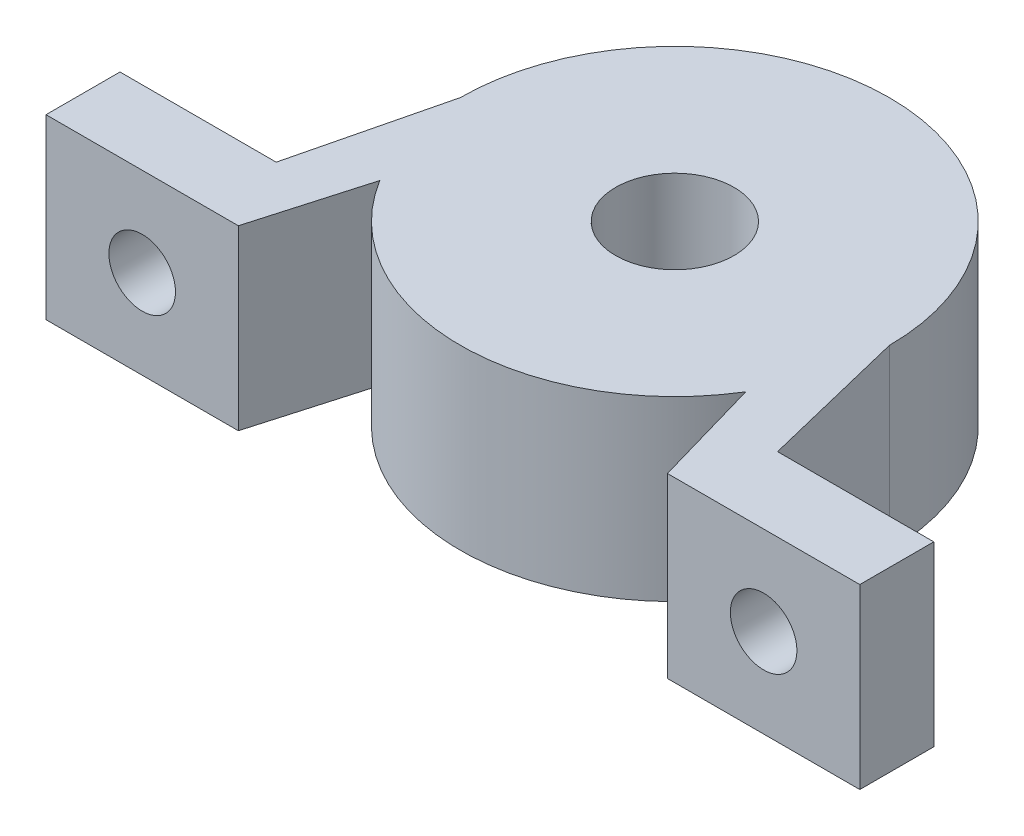
ISO-10303-21;
HEADER;
FILE_DESCRIPTION(('STEP AP214'),'2;1');
FILE_NAME('part.step','',(''),(''),'','','');
FILE_SCHEMA(('AUTOMOTIVE_DESIGN { 1 0 10303 214 1 1 1 1 }'));
ENDSEC;
DATA;
#1=APPLICATION_CONTEXT('core data for automotive mechanical design processes');
#2=APPLICATION_PROTOCOL_DEFINITION('international standard','automotive_design',2000,#1);
#3=PRODUCT_CONTEXT('',#1,'mechanical');
#4=PRODUCT('Part','Part','',(#3));
#5=PRODUCT_RELATED_PRODUCT_CATEGORY('part','',(#4));
#6=PRODUCT_DEFINITION_FORMATION('','',#4);
#7=PRODUCT_DEFINITION_CONTEXT('part definition',#1,'design');
#8=PRODUCT_DEFINITION('design','',#6,#7);
#9=PRODUCT_DEFINITION_SHAPE('','',#8);
#10=(LENGTH_UNIT() NAMED_UNIT(*) SI_UNIT(.MILLI.,.METRE.));
#11=(NAMED_UNIT(*) PLANE_ANGLE_UNIT() SI_UNIT($,.RADIAN.));
#12=(NAMED_UNIT(*) SI_UNIT($,.STERADIAN.) SOLID_ANGLE_UNIT());
#13=UNCERTAINTY_MEASURE_WITH_UNIT(LENGTH_MEASURE(1.E-05),#10,'distance_accuracy_value','');
#14=(GEOMETRIC_REPRESENTATION_CONTEXT(3) GLOBAL_UNCERTAINTY_ASSIGNED_CONTEXT((#13)) GLOBAL_UNIT_ASSIGNED_CONTEXT((#10,
#11,#12)) REPRESENTATION_CONTEXT('',''));
#15=CARTESIAN_POINT('',(0.,0.,0.));
#16=DIRECTION('',(0.,0.,1.));
#17=DIRECTION('',(1.,0.,0.));
#18=AXIS2_PLACEMENT_3D('',#15,#16,#17);
#19=CARTESIAN_POINT('',(0.,12.,0.));
#20=DIRECTION('',(0.,1.,0.));
#21=DIRECTION('',(0.,0.,1.));
#22=AXIS2_PLACEMENT_3D('',#19,#20,#21);
#23=PLANE('',#22);
#24=DIRECTION('',(-1.,0.,0.));
#25=VECTOR('',#24,1.);
#26=CARTESIAN_POINT('',(-27.5,12.,10.));
#27=LINE('',#26,#25);
#28=CARTESIAN_POINT('',(-16.9428664837457,12.,10.));
#29=VERTEX_POINT('',#28);
#30=CARTESIAN_POINT('',(-27.5,12.,10.));
#31=VERTEX_POINT('',#30);
#32=EDGE_CURVE('E177',#29,#31,#27,.T.);
#33=ORIENTED_EDGE('',*,*,#32,.T.);
#34=DIRECTION('',(0.,0.,1.));
#35=VECTOR('',#34,1.);
#36=CARTESIAN_POINT('',(-27.5,12.,10.));
#37=LINE('',#36,#35);
#38=CARTESIAN_POINT('',(-27.5,12.,15.));
#39=VERTEX_POINT('',#38);
#40=EDGE_CURVE('E105',#31,#39,#37,.T.);
#41=ORIENTED_EDGE('',*,*,#40,.T.);
#42=DIRECTION('',(1.,0.,0.));
#43=VECTOR('',#42,1.);
#44=CARTESIAN_POINT('',(-27.5,12.,15.));
#45=LINE('',#44,#43);
#46=CARTESIAN_POINT('',(-14.5,12.,15.));
#47=VERTEX_POINT('',#46);
#48=EDGE_CURVE('E205',#39,#47,#45,.T.);
#49=ORIENTED_EDGE('',*,*,#48,.T.);
#50=DIRECTION('',(0.276037661208606,0.,-0.961146819999152));
#51=VECTOR('',#50,1.);
#52=CARTESIAN_POINT('',(-14.5,12.,15.));
#53=LINE('',#52,#51);
#54=CARTESIAN_POINT('',(-12.3664407470335,12.,7.57107279387208));
#55=VERTEX_POINT('',#54);
#56=EDGE_CURVE('E224',#47,#55,#53,.T.);
#57=ORIENTED_EDGE('',*,*,#56,.T.);
#58=CARTESIAN_POINT('',(0.,12.,0.));
#59=DIRECTION('',(0.,1.,0.));
#60=DIRECTION('',(0.,0.,1.));
#61=AXIS2_PLACEMENT_3D('',#58,#59,#60);
#62=CIRCLE('',#61,14.5);
#63=CARTESIAN_POINT('',(12.3664407470335,12.,7.57107279387208));
#64=VERTEX_POINT('',#63);
#65=EDGE_CURVE('E221',#55,#64,#62,.T.);
#66=ORIENTED_EDGE('',*,*,#65,.T.);
#67=DIRECTION('',(0.276037661208606,0.,0.961146819999152));
#68=VECTOR('',#67,1.);
#69=CARTESIAN_POINT('',(14.5,12.,15.));
#70=LINE('',#69,#68);
#71=CARTESIAN_POINT('',(14.5,12.,15.));
#72=VERTEX_POINT('',#71);
#73=EDGE_CURVE('E223',#64,#72,#70,.T.);
#74=ORIENTED_EDGE('',*,*,#73,.T.);
#75=DIRECTION('',(1.,0.,0.));
#76=VECTOR('',#75,1.);
#77=CARTESIAN_POINT('',(27.5,12.,15.));
#78=LINE('',#77,#76);
#79=CARTESIAN_POINT('',(27.5,12.,15.));
#80=VERTEX_POINT('',#79);
#81=EDGE_CURVE('E226',#72,#80,#78,.T.);
#82=ORIENTED_EDGE('',*,*,#81,.T.);
#83=DIRECTION('',(0.,0.,-1.));
#84=VECTOR('',#83,1.);
#85=CARTESIAN_POINT('',(27.5,12.,10.));
#86=LINE('',#85,#84);
#87=CARTESIAN_POINT('',(27.5,12.,10.));
#88=VERTEX_POINT('',#87);
#89=EDGE_CURVE('E232',#80,#88,#86,.T.);
#90=ORIENTED_EDGE('',*,*,#89,.T.);
#91=DIRECTION('',(-1.,0.,0.));
#92=VECTOR('',#91,1.);
#93=CARTESIAN_POINT('',(27.5,12.,10.));
#94=LINE('',#93,#92);
#95=CARTESIAN_POINT('',(16.9428664837457,12.,10.));
#96=VERTEX_POINT('',#95);
#97=EDGE_CURVE('E136',#88,#96,#94,.T.);
#98=ORIENTED_EDGE('',*,*,#97,.T.);
#99=DIRECTION('',(-0.237308442336912,0.,-0.971434353518357));
#100=VECTOR('',#99,1.);
#101=CARTESIAN_POINT('',(16.9428664837457,12.,10.));
#102=LINE('',#101,#100);
#103=CARTESIAN_POINT('',(14.5,12.,0.));
#104=VERTEX_POINT('',#103);
#105=EDGE_CURVE('E130',#96,#104,#102,.T.);
#106=ORIENTED_EDGE('',*,*,#105,.T.);
#107=CARTESIAN_POINT('',(0.,12.,0.));
#108=DIRECTION('',(0.,1.,0.));
#109=DIRECTION('',(0.,0.,1.));
#110=AXIS2_PLACEMENT_3D('',#107,#108,#109);
#111=CIRCLE('',#110,14.5);
#112=CARTESIAN_POINT('',(-14.5,12.,0.));
#113=VERTEX_POINT('',#112);
#114=EDGE_CURVE('E134',#104,#113,#111,.T.);
#115=ORIENTED_EDGE('',*,*,#114,.T.);
#116=DIRECTION('',(-0.237308442336912,0.,0.971434353518357));
#117=VECTOR('',#116,1.);
#118=CARTESIAN_POINT('',(-16.9428664837457,12.,10.));
#119=LINE('',#118,#117);
#120=EDGE_CURVE('E50',#113,#29,#119,.T.);
#121=ORIENTED_EDGE('',*,*,#120,.T.);
#122=EDGE_LOOP('',(#33,#41,#49,#57,#66,#74,#82,#90,#98,#106,#115,#121));
#123=FACE_BOUND('',#122,.T.);
#124=CARTESIAN_POINT('',(0.,12.,0.));
#125=DIRECTION('',(0.,1.,0.));
#126=DIRECTION('',(0.,0.,1.));
#127=AXIS2_PLACEMENT_3D('',#124,#125,#126);
#128=CIRCLE('',#127,4.);
#129=CARTESIAN_POINT('',(0.,12.,4.));
#130=VERTEX_POINT('',#129);
#131=EDGE_CURVE('E158',#130,#130,#128,.T.);
#132=ORIENTED_EDGE('',*,*,#131,.F.);
#133=EDGE_LOOP('',(#132));
#134=FACE_BOUND('',#133,.T.);
#135=ADVANCED_FACE('F32',(#123,#134),#23,.T.);
#136=CARTESIAN_POINT('',(0.,0.,0.));
#137=DIRECTION('',(0.,1.,0.));
#138=DIRECTION('',(0.,0.,1.));
#139=AXIS2_PLACEMENT_3D('',#136,#137,#138);
#140=PLANE('',#139);
#141=DIRECTION('',(-1.,0.,0.));
#142=VECTOR('',#141,1.);
#143=CARTESIAN_POINT('',(-27.5,0.,10.));
#144=LINE('',#143,#142);
#145=CARTESIAN_POINT('',(-16.9428664837457,0.,10.));
#146=VERTEX_POINT('',#145);
#147=CARTESIAN_POINT('',(-27.5,0.,10.));
#148=VERTEX_POINT('',#147);
#149=EDGE_CURVE('E154',#146,#148,#144,.T.);
#150=ORIENTED_EDGE('',*,*,#149,.F.);
#151=DIRECTION('',(-0.237308442336912,0.,0.971434353518357));
#152=VECTOR('',#151,1.);
#153=CARTESIAN_POINT('',(-16.9428664837457,0.,10.));
#154=LINE('',#153,#152);
#155=CARTESIAN_POINT('',(-14.5,0.,0.));
#156=VERTEX_POINT('',#155);
#157=EDGE_CURVE('E97',#156,#146,#154,.T.);
#158=ORIENTED_EDGE('',*,*,#157,.F.);
#159=CARTESIAN_POINT('',(0.,0.,0.));
#160=DIRECTION('',(0.,1.,0.));
#161=DIRECTION('',(0.,0.,1.));
#162=AXIS2_PLACEMENT_3D('',#159,#160,#161);
#163=CIRCLE('',#162,14.5);
#164=CARTESIAN_POINT('',(14.5,0.,0.));
#165=VERTEX_POINT('',#164);
#166=EDGE_CURVE('E91',#165,#156,#163,.T.);
#167=ORIENTED_EDGE('',*,*,#166,.F.);
#168=DIRECTION('',(-0.237308442336912,0.,-0.971434353518357));
#169=VECTOR('',#168,1.);
#170=CARTESIAN_POINT('',(16.9428664837457,0.,10.));
#171=LINE('',#170,#169);
#172=CARTESIAN_POINT('',(16.9428664837457,0.,10.));
#173=VERTEX_POINT('',#172);
#174=EDGE_CURVE('E144',#173,#165,#171,.T.);
#175=ORIENTED_EDGE('',*,*,#174,.F.);
#176=DIRECTION('',(-1.,0.,0.));
#177=VECTOR('',#176,1.);
#178=CARTESIAN_POINT('',(27.5,0.,10.));
#179=LINE('',#178,#177);
#180=CARTESIAN_POINT('',(27.5,0.,10.));
#181=VERTEX_POINT('',#180);
#182=EDGE_CURVE('E172',#181,#173,#179,.T.);
#183=ORIENTED_EDGE('',*,*,#182,.F.);
#184=DIRECTION('',(0.,0.,-1.));
#185=VECTOR('',#184,1.);
#186=CARTESIAN_POINT('',(27.5,0.,10.));
#187=LINE('',#186,#185);
#188=CARTESIAN_POINT('',(27.5,0.,15.));
#189=VERTEX_POINT('',#188);
#190=EDGE_CURVE('E170',#189,#181,#187,.T.);
#191=ORIENTED_EDGE('',*,*,#190,.F.);
#192=DIRECTION('',(1.,0.,0.));
#193=VECTOR('',#192,1.);
#194=CARTESIAN_POINT('',(27.5,0.,15.));
#195=LINE('',#194,#193);
#196=CARTESIAN_POINT('',(14.5,0.,15.));
#197=VERTEX_POINT('',#196);
#198=EDGE_CURVE('E168',#197,#189,#195,.T.);
#199=ORIENTED_EDGE('',*,*,#198,.F.);
#200=DIRECTION('',(0.276037661208606,0.,0.961146819999152));
#201=VECTOR('',#200,1.);
#202=CARTESIAN_POINT('',(14.5,0.,15.));
#203=LINE('',#202,#201);
#204=CARTESIAN_POINT('',(12.3664407470335,0.,7.57107279387208));
#205=VERTEX_POINT('',#204);
#206=EDGE_CURVE('E166',#205,#197,#203,.T.);
#207=ORIENTED_EDGE('',*,*,#206,.F.);
#208=CARTESIAN_POINT('',(0.,0.,0.));
#209=DIRECTION('',(0.,1.,0.));
#210=DIRECTION('',(0.,0.,1.));
#211=AXIS2_PLACEMENT_3D('',#208,#209,#210);
#212=CIRCLE('',#211,14.5);
#213=CARTESIAN_POINT('',(-12.3664407470335,0.,7.57107279387208));
#214=VERTEX_POINT('',#213);
#215=EDGE_CURVE('E164',#214,#205,#212,.T.);
#216=ORIENTED_EDGE('',*,*,#215,.F.);
#217=DIRECTION('',(0.276037661208606,0.,-0.961146819999152));
#218=VECTOR('',#217,1.);
#219=CARTESIAN_POINT('',(-14.5,0.,15.));
#220=LINE('',#219,#218);
#221=CARTESIAN_POINT('',(-14.5,0.,15.));
#222=VERTEX_POINT('',#221);
#223=EDGE_CURVE('E162',#222,#214,#220,.T.);
#224=ORIENTED_EDGE('',*,*,#223,.F.);
#225=DIRECTION('',(1.,0.,0.));
#226=VECTOR('',#225,1.);
#227=CARTESIAN_POINT('',(-27.5,0.,15.));
#228=LINE('',#227,#226);
#229=CARTESIAN_POINT('',(-27.5,0.,15.));
#230=VERTEX_POINT('',#229);
#231=EDGE_CURVE('E160',#230,#222,#228,.T.);
#232=ORIENTED_EDGE('',*,*,#231,.F.);
#233=DIRECTION('',(0.,0.,1.));
#234=VECTOR('',#233,1.);
#235=CARTESIAN_POINT('',(-27.5,0.,10.));
#236=LINE('',#235,#234);
#237=EDGE_CURVE('E157',#148,#230,#236,.T.);
#238=ORIENTED_EDGE('',*,*,#237,.F.);
#239=EDGE_LOOP('',(#150,#158,#167,#175,#183,#191,#199,#207,#216,#224,#232,#238));
#240=FACE_BOUND('',#239,.T.);
#241=CARTESIAN_POINT('',(0.,0.,0.));
#242=DIRECTION('',(0.,1.,0.));
#243=DIRECTION('',(0.,0.,1.));
#244=AXIS2_PLACEMENT_3D('',#241,#242,#243);
#245=CIRCLE('',#244,4.);
#246=CARTESIAN_POINT('',(0.,0.,4.));
#247=VERTEX_POINT('',#246);
#248=EDGE_CURVE('E288',#247,#247,#245,.T.);
#249=ORIENTED_EDGE('',*,*,#248,.T.);
#250=EDGE_LOOP('',(#249));
#251=FACE_BOUND('',#250,.T.);
#252=ADVANCED_FACE('F209',(#240,#251),#140,.F.);
#253=CARTESIAN_POINT('',(-27.5,12.,10.));
#254=DIRECTION('',(0.,0.,1.));
#255=DIRECTION('',(1.,0.,0.));
#256=AXIS2_PLACEMENT_3D('',#253,#254,#255);
#257=PLANE('',#256);
#258=CARTESIAN_POINT('',(-21.,6.,10.));
#259=DIRECTION('',(0.,0.,1.));
#260=DIRECTION('',(1.,0.,0.));
#261=AXIS2_PLACEMENT_3D('',#258,#259,#260);
#262=CIRCLE('',#261,2.25);
#263=CARTESIAN_POINT('',(-18.75,6.,10.));
#264=VERTEX_POINT('',#263);
#265=EDGE_CURVE('E282',#264,#264,#262,.T.);
#266=ORIENTED_EDGE('',*,*,#265,.T.);
#267=EDGE_LOOP('',(#266));
#268=FACE_BOUND('',#267,.T.);
#269=ORIENTED_EDGE('',*,*,#149,.T.);
#270=DIRECTION('',(0.,-1.,0.));
#271=VECTOR('',#270,1.);
#272=CARTESIAN_POINT('',(-27.5,12.,10.));
#273=LINE('',#272,#271);
#274=EDGE_CURVE('E11',#31,#148,#273,.T.);
#275=ORIENTED_EDGE('',*,*,#274,.F.);
#276=ORIENTED_EDGE('',*,*,#32,.F.);
#277=DIRECTION('',(0.,-1.,0.));
#278=VECTOR('',#277,1.);
#279=CARTESIAN_POINT('',(-16.9428664837457,12.,10.));
#280=LINE('',#279,#278);
#281=EDGE_CURVE('E150',#29,#146,#280,.T.);
#282=ORIENTED_EDGE('',*,*,#281,.T.);
#283=EDGE_LOOP('',(#269,#275,#276,#282));
#284=FACE_BOUND('',#283,.T.);
#285=ADVANCED_FACE('F34',(#268,#284),#257,.F.);
#286=CARTESIAN_POINT('',(-27.5,12.,10.));
#287=DIRECTION('',(1.,0.,0.));
#288=DIRECTION('',(0.,0.,-1.));
#289=AXIS2_PLACEMENT_3D('',#286,#287,#288);
#290=PLANE('',#289);
#291=ORIENTED_EDGE('',*,*,#237,.T.);
#292=DIRECTION('',(0.,-1.,0.));
#293=VECTOR('',#292,1.);
#294=CARTESIAN_POINT('',(-27.5,12.,15.));
#295=LINE('',#294,#293);
#296=EDGE_CURVE('E42',#39,#230,#295,.T.);
#297=ORIENTED_EDGE('',*,*,#296,.F.);
#298=ORIENTED_EDGE('',*,*,#40,.F.);
#299=ORIENTED_EDGE('',*,*,#274,.T.);
#300=EDGE_LOOP('',(#291,#297,#298,#299));
#301=FACE_BOUND('',#300,.T.);
#302=ADVANCED_FACE('F301',(#301),#290,.F.);
#303=CARTESIAN_POINT('',(-27.5,12.,15.));
#304=DIRECTION('',(0.,0.,-1.));
#305=DIRECTION('',(-1.,0.,0.));
#306=AXIS2_PLACEMENT_3D('',#303,#304,#305);
#307=PLANE('',#306);
#308=CARTESIAN_POINT('',(-21.,6.,15.));
#309=DIRECTION('',(0.,0.,1.));
#310=DIRECTION('',(1.,0.,0.));
#311=AXIS2_PLACEMENT_3D('',#308,#309,#310);
#312=CIRCLE('',#311,2.25);
#313=CARTESIAN_POINT('',(-18.75,6.,15.));
#314=VERTEX_POINT('',#313);
#315=EDGE_CURVE('E280',#314,#314,#312,.T.);
#316=ORIENTED_EDGE('',*,*,#315,.F.);
#317=EDGE_LOOP('',(#316));
#318=FACE_BOUND('',#317,.T.);
#319=ORIENTED_EDGE('',*,*,#231,.T.);
#320=DIRECTION('',(0.,-1.,0.));
#321=VECTOR('',#320,1.);
#322=CARTESIAN_POINT('',(-14.5,12.,15.));
#323=LINE('',#322,#321);
#324=EDGE_CURVE('E196',#47,#222,#323,.T.);
#325=ORIENTED_EDGE('',*,*,#324,.F.);
#326=ORIENTED_EDGE('',*,*,#48,.F.);
#327=ORIENTED_EDGE('',*,*,#296,.T.);
#328=EDGE_LOOP('',(#319,#325,#326,#327));
#329=FACE_BOUND('',#328,.T.);
#330=ADVANCED_FACE('F203',(#318,#329),#307,.F.);
#331=CARTESIAN_POINT('',(-14.5,12.,15.));
#332=DIRECTION('',(-0.961146819999152,0.,-0.276037661208606));
#333=DIRECTION('',(-0.276037661208606,0.,0.961146819999152));
#334=AXIS2_PLACEMENT_3D('',#331,#332,#333);
#335=PLANE('',#334);
#336=ORIENTED_EDGE('',*,*,#223,.T.);
#337=DIRECTION('',(0.,-1.,0.));
#338=VECTOR('',#337,1.);
#339=CARTESIAN_POINT('',(-12.3664407470335,12.,7.57107279387208));
#340=LINE('',#339,#338);
#341=EDGE_CURVE('E193',#55,#214,#340,.T.);
#342=ORIENTED_EDGE('',*,*,#341,.F.);
#343=ORIENTED_EDGE('',*,*,#56,.F.);
#344=ORIENTED_EDGE('',*,*,#324,.T.);
#345=EDGE_LOOP('',(#336,#342,#343,#344));
#346=FACE_BOUND('',#345,.T.);
#347=ADVANCED_FACE('F215',(#346),#335,.F.);
#348=CARTESIAN_POINT('',(0.,12.,0.));
#349=DIRECTION('',(0.,-1.,0.));
#350=DIRECTION('',(0.,0.,-1.));
#351=AXIS2_PLACEMENT_3D('',#348,#349,#350);
#352=CYLINDRICAL_SURFACE('',#351,14.5);
#353=ORIENTED_EDGE('',*,*,#215,.T.);
#354=DIRECTION('',(0.,-1.,0.));
#355=VECTOR('',#354,1.);
#356=CARTESIAN_POINT('',(12.3664407470335,12.,7.57107279387208));
#357=LINE('',#356,#355);
#358=EDGE_CURVE('E190',#64,#205,#357,.T.);
#359=ORIENTED_EDGE('',*,*,#358,.F.);
#360=ORIENTED_EDGE('',*,*,#65,.F.);
#361=ORIENTED_EDGE('',*,*,#341,.T.);
#362=EDGE_LOOP('',(#353,#359,#360,#361));
#363=FACE_BOUND('',#362,.T.);
#364=ADVANCED_FACE('F219',(#363),#352,.T.);
#365=CARTESIAN_POINT('',(14.5,12.,15.));
#366=DIRECTION('',(0.961146819999152,0.,-0.276037661208606));
#367=DIRECTION('',(-0.276037661208606,0.,-0.961146819999152));
#368=AXIS2_PLACEMENT_3D('',#365,#366,#367);
#369=PLANE('',#368);
#370=ORIENTED_EDGE('',*,*,#206,.T.);
#371=DIRECTION('',(0.,-1.,0.));
#372=VECTOR('',#371,1.);
#373=CARTESIAN_POINT('',(14.5,12.,15.));
#374=LINE('',#373,#372);
#375=EDGE_CURVE('E187',#72,#197,#374,.T.);
#376=ORIENTED_EDGE('',*,*,#375,.F.);
#377=ORIENTED_EDGE('',*,*,#73,.F.);
#378=ORIENTED_EDGE('',*,*,#358,.T.);
#379=EDGE_LOOP('',(#370,#376,#377,#378));
#380=FACE_BOUND('',#379,.T.);
#381=ADVANCED_FACE('F315',(#380),#369,.F.);
#382=CARTESIAN_POINT('',(27.5,12.,15.));
#383=DIRECTION('',(0.,0.,-1.));
#384=DIRECTION('',(-1.,0.,0.));
#385=AXIS2_PLACEMENT_3D('',#382,#383,#384);
#386=PLANE('',#385);
#387=CARTESIAN_POINT('',(21.,6.,15.));
#388=DIRECTION('',(0.,0.,1.));
#389=DIRECTION('',(1.,0.,0.));
#390=AXIS2_PLACEMENT_3D('',#387,#388,#389);
#391=CIRCLE('',#390,2.25);
#392=CARTESIAN_POINT('',(23.25,6.,15.));
#393=VERTEX_POINT('',#392);
#394=EDGE_CURVE('E276',#393,#393,#391,.T.);
#395=ORIENTED_EDGE('',*,*,#394,.F.);
#396=EDGE_LOOP('',(#395));
#397=FACE_BOUND('',#396,.T.);
#398=ORIENTED_EDGE('',*,*,#198,.T.);
#399=DIRECTION('',(0.,-1.,0.));
#400=VECTOR('',#399,1.);
#401=CARTESIAN_POINT('',(27.5,12.,15.));
#402=LINE('',#401,#400);
#403=EDGE_CURVE('E184',#80,#189,#402,.T.);
#404=ORIENTED_EDGE('',*,*,#403,.F.);
#405=ORIENTED_EDGE('',*,*,#81,.F.);
#406=ORIENTED_EDGE('',*,*,#375,.T.);
#407=EDGE_LOOP('',(#398,#404,#405,#406));
#408=FACE_BOUND('',#407,.T.);
#409=ADVANCED_FACE('F318',(#397,#408),#386,.F.);
#410=CARTESIAN_POINT('',(27.5,12.,10.));
#411=DIRECTION('',(-1.,0.,0.));
#412=DIRECTION('',(0.,0.,1.));
#413=AXIS2_PLACEMENT_3D('',#410,#411,#412);
#414=PLANE('',#413);
#415=ORIENTED_EDGE('',*,*,#190,.T.);
#416=DIRECTION('',(0.,-1.,0.));
#417=VECTOR('',#416,1.);
#418=CARTESIAN_POINT('',(27.5,12.,10.));
#419=LINE('',#418,#417);
#420=EDGE_CURVE('E181',#88,#181,#419,.T.);
#421=ORIENTED_EDGE('',*,*,#420,.F.);
#422=ORIENTED_EDGE('',*,*,#89,.F.);
#423=ORIENTED_EDGE('',*,*,#403,.T.);
#424=EDGE_LOOP('',(#415,#421,#422,#423));
#425=FACE_BOUND('',#424,.T.);
#426=ADVANCED_FACE('F238',(#425),#414,.F.);
#427=CARTESIAN_POINT('',(27.5,12.,10.));
#428=DIRECTION('',(0.,0.,1.));
#429=DIRECTION('',(1.,0.,0.));
#430=AXIS2_PLACEMENT_3D('',#427,#428,#429);
#431=PLANE('',#430);
#432=CARTESIAN_POINT('',(21.,6.,10.));
#433=DIRECTION('',(0.,0.,1.));
#434=DIRECTION('',(1.,0.,0.));
#435=AXIS2_PLACEMENT_3D('',#432,#433,#434);
#436=CIRCLE('',#435,2.25);
#437=CARTESIAN_POINT('',(23.25,6.,10.));
#438=VERTEX_POINT('',#437);
#439=EDGE_CURVE('E36',#438,#438,#436,.T.);
#440=ORIENTED_EDGE('',*,*,#439,.T.);
#441=EDGE_LOOP('',(#440));
#442=FACE_BOUND('',#441,.T.);
#443=ORIENTED_EDGE('',*,*,#182,.T.);
#444=DIRECTION('',(0.,-1.,0.));
#445=VECTOR('',#444,1.);
#446=CARTESIAN_POINT('',(16.9428664837457,12.,10.));
#447=LINE('',#446,#445);
#448=EDGE_CURVE('E145',#96,#173,#447,.T.);
#449=ORIENTED_EDGE('',*,*,#448,.F.);
#450=ORIENTED_EDGE('',*,*,#97,.F.);
#451=ORIENTED_EDGE('',*,*,#420,.T.);
#452=EDGE_LOOP('',(#443,#449,#450,#451));
#453=FACE_BOUND('',#452,.T.);
#454=ADVANCED_FACE('F242',(#442,#453),#431,.F.);
#455=CARTESIAN_POINT('',(16.9428664837457,12.,10.));
#456=DIRECTION('',(-0.971434353518357,0.,0.237308442336912));
#457=DIRECTION('',(0.237308442336912,0.,0.971434353518357));
#458=AXIS2_PLACEMENT_3D('',#455,#456,#457);
#459=PLANE('',#458);
#460=ORIENTED_EDGE('',*,*,#174,.T.);
#461=DIRECTION('',(0.,-1.,0.));
#462=VECTOR('',#461,1.);
#463=CARTESIAN_POINT('',(14.5,12.,0.));
#464=LINE('',#463,#462);
#465=EDGE_CURVE('E141',#104,#165,#464,.T.);
#466=ORIENTED_EDGE('',*,*,#465,.F.);
#467=ORIENTED_EDGE('',*,*,#105,.F.);
#468=ORIENTED_EDGE('',*,*,#448,.T.);
#469=EDGE_LOOP('',(#460,#466,#467,#468));
#470=FACE_BOUND('',#469,.T.);
#471=ADVANCED_FACE('F142',(#470),#459,.F.);
#472=CARTESIAN_POINT('',(0.,12.,0.));
#473=DIRECTION('',(0.,-1.,0.));
#474=DIRECTION('',(0.,0.,-1.));
#475=AXIS2_PLACEMENT_3D('',#472,#473,#474);
#476=CYLINDRICAL_SURFACE('',#475,14.5);
#477=ORIENTED_EDGE('',*,*,#166,.T.);
#478=DIRECTION('',(0.,-1.,0.));
#479=VECTOR('',#478,1.);
#480=CARTESIAN_POINT('',(-14.5,12.,0.));
#481=LINE('',#480,#479);
#482=EDGE_CURVE('E146',#113,#156,#481,.T.);
#483=ORIENTED_EDGE('',*,*,#482,.F.);
#484=ORIENTED_EDGE('',*,*,#114,.F.);
#485=ORIENTED_EDGE('',*,*,#465,.T.);
#486=EDGE_LOOP('',(#477,#483,#484,#485));
#487=FACE_BOUND('',#486,.T.);
#488=ADVANCED_FACE('F148',(#487),#476,.T.);
#489=CARTESIAN_POINT('',(-16.9428664837457,12.,10.));
#490=DIRECTION('',(0.971434353518357,0.,0.237308442336912));
#491=DIRECTION('',(0.237308442336912,0.,-0.971434353518357));
#492=AXIS2_PLACEMENT_3D('',#489,#490,#491);
#493=PLANE('',#492);
#494=ORIENTED_EDGE('',*,*,#157,.T.);
#495=ORIENTED_EDGE('',*,*,#281,.F.);
#496=ORIENTED_EDGE('',*,*,#120,.F.);
#497=ORIENTED_EDGE('',*,*,#482,.T.);
#498=EDGE_LOOP('',(#494,#495,#496,#497));
#499=FACE_BOUND('',#498,.T.);
#500=ADVANCED_FACE('F246',(#499),#493,.F.);
#501=CARTESIAN_POINT('',(0.,12.,0.));
#502=DIRECTION('',(0.,-1.,0.));
#503=DIRECTION('',(0.,0.,-1.));
#504=AXIS2_PLACEMENT_3D('',#501,#502,#503);
#505=CYLINDRICAL_SURFACE('',#504,4.);
#506=ORIENTED_EDGE('',*,*,#131,.T.);
#507=EDGE_LOOP('',(#506));
#508=FACE_BOUND('',#507,.T.);
#509=ORIENTED_EDGE('',*,*,#248,.F.);
#510=EDGE_LOOP('',(#509));
#511=FACE_BOUND('',#510,.T.);
#512=ADVANCED_FACE('F248',(#508,#511),#505,.F.);
#513=CARTESIAN_POINT('',(-21.,6.,3.));
#514=DIRECTION('',(0.,0.,1.));
#515=DIRECTION('',(1.,0.,0.));
#516=AXIS2_PLACEMENT_3D('',#513,#514,#515);
#517=CYLINDRICAL_SURFACE('',#516,2.25);
#518=ORIENTED_EDGE('',*,*,#315,.T.);
#519=EDGE_LOOP('',(#518));
#520=FACE_BOUND('',#519,.T.);
#521=ORIENTED_EDGE('',*,*,#265,.F.);
#522=EDGE_LOOP('',(#521));
#523=FACE_BOUND('',#522,.T.);
#524=ADVANCED_FACE('F254',(#520,#523),#517,.F.);
#525=CARTESIAN_POINT('',(21.,6.,3.));
#526=DIRECTION('',(0.,0.,1.));
#527=DIRECTION('',(1.,0.,0.));
#528=AXIS2_PLACEMENT_3D('',#525,#526,#527);
#529=CYLINDRICAL_SURFACE('',#528,2.25);
#530=ORIENTED_EDGE('',*,*,#394,.T.);
#531=EDGE_LOOP('',(#530));
#532=FACE_BOUND('',#531,.T.);
#533=ORIENTED_EDGE('',*,*,#439,.F.);
#534=EDGE_LOOP('',(#533));
#535=FACE_BOUND('',#534,.T.);
#536=ADVANCED_FACE('F267',(#532,#535),#529,.F.);
#537=CLOSED_SHELL('',(#135,#252,#285,#302,#330,#347,#364,#381,#409,#426,#454,#471,#488,#500,
#512,#524,#536));
#538=MANIFOLD_SOLID_BREP('B2',#537);
#539=ADVANCED_BREP_SHAPE_REPRESENTATION('',(#18,#538),#14);
#540=SHAPE_DEFINITION_REPRESENTATION(#9,#539);
ENDSEC;
END-ISO-10303-21;
